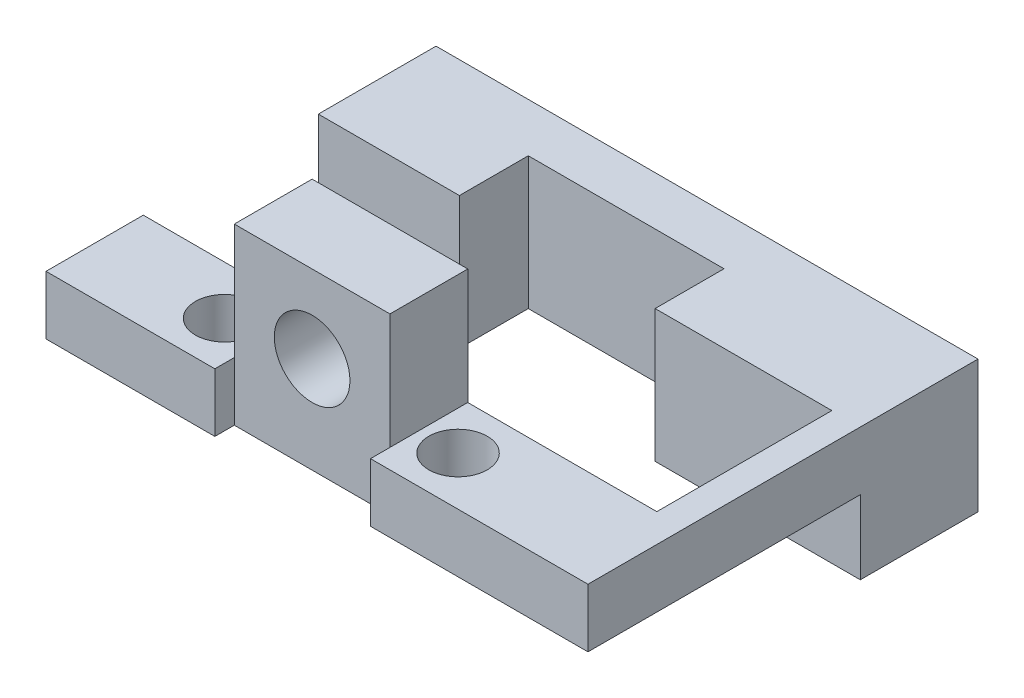
ISO-10303-21;
HEADER;
FILE_DESCRIPTION(('STEP AP214'),'2;1');
FILE_NAME('part.step','',(''),(''),'','','');
FILE_SCHEMA(('AUTOMOTIVE_DESIGN { 1 0 10303 214 1 1 1 1 }'));
ENDSEC;
DATA;
#1=APPLICATION_CONTEXT('core data for automotive mechanical design processes');
#2=APPLICATION_PROTOCOL_DEFINITION('international standard','automotive_design',2000,#1);
#3=PRODUCT_CONTEXT('',#1,'mechanical');
#4=PRODUCT('Part','Part','',(#3));
#5=PRODUCT_RELATED_PRODUCT_CATEGORY('part','',(#4));
#6=PRODUCT_DEFINITION_FORMATION('','',#4);
#7=PRODUCT_DEFINITION_CONTEXT('part definition',#1,'design');
#8=PRODUCT_DEFINITION('design','',#6,#7);
#9=PRODUCT_DEFINITION_SHAPE('','',#8);
#10=(LENGTH_UNIT() NAMED_UNIT(*) SI_UNIT(.MILLI.,.METRE.));
#11=(NAMED_UNIT(*) PLANE_ANGLE_UNIT() SI_UNIT($,.RADIAN.));
#12=(NAMED_UNIT(*) SI_UNIT($,.STERADIAN.) SOLID_ANGLE_UNIT());
#13=UNCERTAINTY_MEASURE_WITH_UNIT(LENGTH_MEASURE(1.E-05),#10,'distance_accuracy_value','');
#14=(GEOMETRIC_REPRESENTATION_CONTEXT(3) GLOBAL_UNCERTAINTY_ASSIGNED_CONTEXT((#13)) GLOBAL_UNIT_ASSIGNED_CONTEXT((#10,
#11,#12)) REPRESENTATION_CONTEXT('',''));
#15=CARTESIAN_POINT('',(0.,0.,0.));
#16=DIRECTION('',(0.,0.,1.));
#17=DIRECTION('',(1.,0.,0.));
#18=AXIS2_PLACEMENT_3D('',#15,#16,#17);
#19=CARTESIAN_POINT('',(-115.927075049262,72.3641175869503,-8.99747351405628));
#20=DIRECTION('',(0.,0.,1.));
#21=DIRECTION('',(1.,0.,0.));
#22=AXIS2_PLACEMENT_3D('',#19,#20,#21);
#23=PLANE('',#22);
#24=DIRECTION('',(0.,1.,0.));
#25=VECTOR('',#24,1.);
#26=CARTESIAN_POINT('',(-115.090412929412,72.3641175869503,-8.99747351405628));
#27=LINE('',#26,#25);
#28=CARTESIAN_POINT('',(-115.090412929412,68.5720536597553,-8.99747351405628));
#29=VERTEX_POINT('',#28);
#30=CARTESIAN_POINT('',(-115.090412929412,75.3756723250068,-8.99747351405628));
#31=VERTEX_POINT('',#30);
#32=EDGE_CURVE('E268',#29,#31,#27,.T.);
#33=ORIENTED_EDGE('',*,*,#32,.F.);
#34=DIRECTION('',(-1.,0.,0.));
#35=VECTOR('',#34,1.);
#36=CARTESIAN_POINT('',(-107.839255233851,68.5720536597553,-8.99747351405628));
#37=LINE('',#36,#35);
#38=CARTESIAN_POINT('',(-107.839255233851,68.5720536597553,-8.99747351405628));
#39=VERTEX_POINT('',#38);
#40=EDGE_CURVE('E180',#39,#29,#37,.T.);
#41=ORIENTED_EDGE('',*,*,#40,.F.);
#42=DIRECTION('',(0.,1.,0.));
#43=VECTOR('',#42,1.);
#44=CARTESIAN_POINT('',(-107.839255233851,69.5709320094176,-8.99747351405628));
#45=LINE('',#44,#43);
#46=CARTESIAN_POINT('',(-107.839255233851,75.3756723250068,-8.99747351405628));
#47=VERTEX_POINT('',#46);
#48=EDGE_CURVE('E424',#39,#47,#45,.T.);
#49=ORIENTED_EDGE('',*,*,#48,.T.);
#50=DIRECTION('',(1.,0.,0.));
#51=VECTOR('',#50,1.);
#52=CARTESIAN_POINT('',(-115.927075049262,75.3756723250068,-8.99747351405628));
#53=LINE('',#52,#51);
#54=EDGE_CURVE('E302',#31,#47,#53,.T.);
#55=ORIENTED_EDGE('',*,*,#54,.F.);
#56=EDGE_LOOP('',(#33,#41,#49,#55));
#57=FACE_BOUND('',#56,.T.);
#58=ADVANCED_FACE('F38',(#57),#23,.T.);
#59=CARTESIAN_POINT('',(-87.2332125363838,0.,0.));
#60=DIRECTION('',(1.,0.,0.));
#61=DIRECTION('',(0.,0.,-1.));
#62=AXIS2_PLACEMENT_3D('',#59,#60,#61);
#63=PLANE('',#62);
#64=DIRECTION('',(0.,1.,0.));
#65=VECTOR('',#64,1.);
#66=CARTESIAN_POINT('',(-87.2332125363838,59.9643896199509,-8.99747351405628));
#67=LINE('',#66,#65);
#68=CARTESIAN_POINT('',(-87.2332125363838,68.5720536597553,-8.99747351405628));
#69=VERTEX_POINT('',#68);
#70=CARTESIAN_POINT('',(-87.2332125363838,72.3641175869503,-8.99747351405628));
#71=VERTEX_POINT('',#70);
#72=EDGE_CURVE('E205',#69,#71,#67,.T.);
#73=ORIENTED_EDGE('',*,*,#72,.F.);
#74=DIRECTION('',(0.,0.,1.));
#75=VECTOR('',#74,1.);
#76=CARTESIAN_POINT('',(-87.2332125363838,68.5720536597553,-15.0472417515523));
#77=LINE('',#76,#75);
#78=CARTESIAN_POINT('',(-87.2332125363838,68.5720536597553,-15.0472417515523));
#79=VERTEX_POINT('',#78);
#80=EDGE_CURVE('E194',#79,#69,#77,.T.);
#81=ORIENTED_EDGE('',*,*,#80,.F.);
#82=DIRECTION('',(0.,1.,0.));
#83=VECTOR('',#82,1.);
#84=CARTESIAN_POINT('',(-87.2332125363838,69.5720536597553,-15.0472417515523));
#85=LINE('',#84,#83);
#86=CARTESIAN_POINT('',(-87.2332125363838,75.3756723250068,-15.0472417515523));
#87=VERTEX_POINT('',#86);
#88=EDGE_CURVE('E192',#79,#87,#85,.T.);
#89=ORIENTED_EDGE('',*,*,#88,.T.);
#90=DIRECTION('',(0.,0.,1.));
#91=VECTOR('',#90,1.);
#92=CARTESIAN_POINT('',(-87.2332125363838,75.3756723250068,0.));
#93=LINE('',#92,#91);
#94=CARTESIAN_POINT('',(-87.2332125363838,75.3756723250068,5.));
#95=VERTEX_POINT('',#94);
#96=EDGE_CURVE('E324',#87,#95,#93,.T.);
#97=ORIENTED_EDGE('',*,*,#96,.T.);
#98=DIRECTION('',(0.,-1.,0.));
#99=VECTOR('',#98,1.);
#100=CARTESIAN_POINT('',(-87.2332125363838,75.3756723250068,5.));
#101=LINE('',#100,#99);
#102=CARTESIAN_POINT('',(-87.2332125363838,72.3641175869503,5.));
#103=VERTEX_POINT('',#102);
#104=EDGE_CURVE('E327',#95,#103,#101,.T.);
#105=ORIENTED_EDGE('',*,*,#104,.T.);
#106=DIRECTION('',(0.,0.,-1.));
#107=VECTOR('',#106,1.);
#108=CARTESIAN_POINT('',(-87.2332125363838,72.3641175869503,5.));
#109=LINE('',#108,#107);
#110=EDGE_CURVE('E315',#103,#71,#109,.T.);
#111=ORIENTED_EDGE('',*,*,#110,.T.);
#112=EDGE_LOOP('',(#73,#81,#89,#97,#105,#111));
#113=FACE_BOUND('',#112,.T.);
#114=ADVANCED_FACE('F387',(#113),#63,.T.);
#115=DIRECTION('',(0.,1.,0.));
#116=VECTOR('',#115,1.);
#117=CARTESIAN_POINT('',(-97.7794834399905,69.5662453583504,-8.99747351405628));
#118=LINE('',#117,#116);
#119=CARTESIAN_POINT('',(-97.7794834399905,68.5720536597553,-8.99747351405628));
#120=VERTEX_POINT('',#119);
#121=CARTESIAN_POINT('',(-97.7794834399905,75.3756723250068,-8.99747351405628));
#122=VERTEX_POINT('',#121);
#123=EDGE_CURVE('E408',#120,#122,#118,.T.);
#124=ORIENTED_EDGE('',*,*,#123,.F.);
#125=DIRECTION('',(-1.,0.,0.));
#126=VECTOR('',#125,1.);
#127=CARTESIAN_POINT('',(-87.2332125363838,68.5720536597553,-8.99747351405628));
#128=LINE('',#127,#126);
#129=EDGE_CURVE('E409',#69,#120,#128,.T.);
#130=ORIENTED_EDGE('',*,*,#129,.F.);
#131=ORIENTED_EDGE('',*,*,#72,.T.);
#132=DIRECTION('',(-1.,0.,0.));
#133=VECTOR('',#132,1.);
#134=CARTESIAN_POINT('',(-95.7794834399905,72.3641175869503,-8.99747351405628));
#135=LINE('',#134,#133);
#136=CARTESIAN_POINT('',(-89.2348545159608,72.3641175869503,-8.99747351405628));
#137=VERTEX_POINT('',#136);
#138=EDGE_CURVE('E201',#71,#137,#135,.T.);
#139=ORIENTED_EDGE('',*,*,#138,.T.);
#140=DIRECTION('',(-0.176425480574125,-0.984313999597786,0.));
#141=VECTOR('',#140,1.);
#142=CARTESIAN_POINT('',(-88.6950725031539,75.3756723250068,-8.99747351405628));
#143=LINE('',#142,#141);
#144=CARTESIAN_POINT('',(-88.6950725031539,75.3756723250068,-8.99747351405628));
#145=VERTEX_POINT('',#144);
#146=EDGE_CURVE('E306',#145,#137,#143,.T.);
#147=ORIENTED_EDGE('',*,*,#146,.F.);
#148=EDGE_CURVE('E301',#122,#145,#53,.T.);
#149=ORIENTED_EDGE('',*,*,#148,.F.);
#150=EDGE_LOOP('',(#124,#130,#131,#139,#147,#149));
#151=FACE_BOUND('',#150,.T.);
#152=ADVANCED_FACE('F390',(#151),#23,.T.);
#153=CARTESIAN_POINT('',(-115.090412929412,76.3641175869503,0.));
#154=DIRECTION('',(1.,0.,0.));
#155=DIRECTION('',(0.,0.,-1.));
#156=AXIS2_PLACEMENT_3D('',#153,#154,#155);
#157=PLANE('',#156);
#158=DIRECTION('',(0.,0.,-1.));
#159=VECTOR('',#158,1.);
#160=CARTESIAN_POINT('',(-115.090412929412,68.5720536597553,-8.99747351405628));
#161=LINE('',#160,#159);
#162=CARTESIAN_POINT('',(-115.090412929412,68.5720536597553,-15.0472417515523));
#163=VERTEX_POINT('',#162);
#164=EDGE_CURVE('E174',#29,#163,#161,.T.);
#165=ORIENTED_EDGE('',*,*,#164,.F.);
#166=ORIENTED_EDGE('',*,*,#32,.T.);
#167=DIRECTION('',(0.,0.,1.));
#168=VECTOR('',#167,1.);
#169=CARTESIAN_POINT('',(-115.090412929412,75.3756723250068,5.));
#170=LINE('',#169,#168);
#171=CARTESIAN_POINT('',(-115.090412929412,75.3756723250068,-15.0472417515523));
#172=VERTEX_POINT('',#171);
#173=EDGE_CURVE('E198',#172,#31,#170,.T.);
#174=ORIENTED_EDGE('',*,*,#173,.F.);
#175=DIRECTION('',(0.,1.,0.));
#176=VECTOR('',#175,1.);
#177=CARTESIAN_POINT('',(-115.090412929412,69.5720536597553,-15.0472417515523));
#178=LINE('',#177,#176);
#179=EDGE_CURVE('E190',#163,#172,#178,.T.);
#180=ORIENTED_EDGE('',*,*,#179,.F.);
#181=EDGE_LOOP('',(#165,#166,#174,#180));
#182=FACE_BOUND('',#181,.T.);
#183=ADVANCED_FACE('F196',(#182),#157,.F.);
#184=CARTESIAN_POINT('',(-87.2332125363838,69.5720536597553,-15.0472417515523));
#185=DIRECTION('',(0.,0.,-1.));
#186=DIRECTION('',(-1.,0.,0.));
#187=AXIS2_PLACEMENT_3D('',#184,#185,#186);
#188=PLANE('',#187);
#189=ORIENTED_EDGE('',*,*,#88,.F.);
#190=DIRECTION('',(1.,0.,0.));
#191=VECTOR('',#190,1.);
#192=CARTESIAN_POINT('',(-115.090412929412,68.5720536597553,-15.0472417515523));
#193=LINE('',#192,#191);
#194=EDGE_CURVE('E177',#163,#79,#193,.T.);
#195=ORIENTED_EDGE('',*,*,#194,.F.);
#196=ORIENTED_EDGE('',*,*,#179,.T.);
#197=DIRECTION('',(-1.,0.,0.));
#198=VECTOR('',#197,1.);
#199=CARTESIAN_POINT('',(-87.2332125363838,75.3756723250068,-15.0472417515523));
#200=LINE('',#199,#198);
#201=EDGE_CURVE('E207',#87,#172,#200,.T.);
#202=ORIENTED_EDGE('',*,*,#201,.F.);
#203=EDGE_LOOP('',(#189,#195,#196,#202));
#204=FACE_BOUND('',#203,.T.);
#205=ADVANCED_FACE('F188',(#204),#188,.T.);
#206=CARTESIAN_POINT('',(-108.839255233851,69.5709320094176,-12.5383641954253));
#207=DIRECTION('',(0.,0.,-1.));
#208=DIRECTION('',(-1.,0.,0.));
#209=AXIS2_PLACEMENT_3D('',#206,#207,#208);
#210=PLANE('',#209);
#211=DIRECTION('',(-1.,0.,0.));
#212=VECTOR('',#211,1.);
#213=CARTESIAN_POINT('',(-97.7794834399905,68.5720536597553,-12.5383641954253));
#214=LINE('',#213,#212);
#215=CARTESIAN_POINT('',(-97.7794834399905,68.5720536597553,-12.5383641954253));
#216=VERTEX_POINT('',#215);
#217=CARTESIAN_POINT('',(-107.839255233851,68.5720536597553,-12.5383641954253));
#218=VERTEX_POINT('',#217);
#219=EDGE_CURVE('E54',#216,#218,#214,.T.);
#220=ORIENTED_EDGE('',*,*,#219,.F.);
#221=DIRECTION('',(0.,1.,0.));
#222=VECTOR('',#221,1.);
#223=CARTESIAN_POINT('',(-97.7794834399905,69.5709320094176,-12.5383641954253));
#224=LINE('',#223,#222);
#225=CARTESIAN_POINT('',(-97.7794834399905,75.3756723250068,-12.5383641954253));
#226=VERTEX_POINT('',#225);
#227=EDGE_CURVE('E11',#216,#226,#224,.T.);
#228=ORIENTED_EDGE('',*,*,#227,.T.);
#229=DIRECTION('',(-1.,0.,0.));
#230=VECTOR('',#229,1.);
#231=CARTESIAN_POINT('',(-108.839255233851,75.3756723250068,-12.5383641954253));
#232=LINE('',#231,#230);
#233=CARTESIAN_POINT('',(-107.839255233851,75.3756723250068,-12.5383641954253));
#234=VERTEX_POINT('',#233);
#235=EDGE_CURVE('E417',#226,#234,#232,.T.);
#236=ORIENTED_EDGE('',*,*,#235,.T.);
#237=DIRECTION('',(0.,1.,0.));
#238=VECTOR('',#237,1.);
#239=CARTESIAN_POINT('',(-107.839255233851,69.5709320094176,-12.5383641954253));
#240=LINE('',#239,#238);
#241=EDGE_CURVE('E61',#218,#234,#240,.T.);
#242=ORIENTED_EDGE('',*,*,#241,.F.);
#243=EDGE_LOOP('',(#220,#228,#236,#242));
#244=FACE_BOUND('',#243,.T.);
#245=ADVANCED_FACE('F512',(#244),#210,.F.);
#246=CARTESIAN_POINT('',(-97.7794834399905,69.5662453583504,-8.99747351405628));
#247=DIRECTION('',(-1.,0.,0.));
#248=DIRECTION('',(0.,0.,1.));
#249=AXIS2_PLACEMENT_3D('',#246,#247,#248);
#250=PLANE('',#249);
#251=ORIENTED_EDGE('',*,*,#227,.F.);
#252=DIRECTION('',(0.,0.,-1.));
#253=VECTOR('',#252,1.);
#254=CARTESIAN_POINT('',(-97.7794834399905,68.5720536597553,-8.99747351405628));
#255=LINE('',#254,#253);
#256=EDGE_CURVE('E440',#120,#216,#255,.T.);
#257=ORIENTED_EDGE('',*,*,#256,.F.);
#258=ORIENTED_EDGE('',*,*,#123,.T.);
#259=DIRECTION('',(0.,0.,1.));
#260=VECTOR('',#259,1.);
#261=CARTESIAN_POINT('',(-97.7794834399905,75.3756723250068,-8.99747351405628));
#262=LINE('',#261,#260);
#263=EDGE_CURVE('E418',#226,#122,#262,.T.);
#264=ORIENTED_EDGE('',*,*,#263,.F.);
#265=EDGE_LOOP('',(#251,#257,#258,#264));
#266=FACE_BOUND('',#265,.T.);
#267=ADVANCED_FACE('F511',(#266),#250,.T.);
#268=CARTESIAN_POINT('',(-107.839255233851,69.5709320094176,-8.99747351405628));
#269=DIRECTION('',(1.,0.,0.));
#270=DIRECTION('',(0.,0.,-1.));
#271=AXIS2_PLACEMENT_3D('',#268,#269,#270);
#272=PLANE('',#271);
#273=ORIENTED_EDGE('',*,*,#48,.F.);
#274=DIRECTION('',(0.,0.,1.));
#275=VECTOR('',#274,1.);
#276=CARTESIAN_POINT('',(-107.839255233851,68.5720536597553,-12.5383641954253));
#277=LINE('',#276,#275);
#278=EDGE_CURVE('E435',#218,#39,#277,.T.);
#279=ORIENTED_EDGE('',*,*,#278,.F.);
#280=ORIENTED_EDGE('',*,*,#241,.T.);
#281=DIRECTION('',(0.,0.,-1.));
#282=VECTOR('',#281,1.);
#283=CARTESIAN_POINT('',(-107.839255233851,75.3756723250068,-8.99747351405628));
#284=LINE('',#283,#282);
#285=EDGE_CURVE('E427',#47,#234,#284,.T.);
#286=ORIENTED_EDGE('',*,*,#285,.F.);
#287=EDGE_LOOP('',(#273,#279,#280,#286));
#288=FACE_BOUND('',#287,.T.);
#289=ADVANCED_FACE('F507',(#288),#272,.T.);
#290=CARTESIAN_POINT('',(-114.442913217313,72.3641175869503,5.));
#291=DIRECTION('',(0.,1.,0.));
#292=DIRECTION('',(0.,0.,1.));
#293=AXIS2_PLACEMENT_3D('',#290,#291,#292);
#294=PLANE('',#293);
#295=CARTESIAN_POINT('',(-108.41180304333,72.3641175869503,2.5));
#296=DIRECTION('',(0.,1.,0.));
#297=DIRECTION('',(0.,0.,1.));
#298=AXIS2_PLACEMENT_3D('',#295,#296,#297);
#299=CIRCLE('',#298,1.5);
#300=CARTESIAN_POINT('',(-108.41180304333,72.3641175869503,4.));
#301=VERTEX_POINT('',#300);
#302=EDGE_CURVE('E253',#301,#301,#299,.T.);
#303=ORIENTED_EDGE('',*,*,#302,.T.);
#304=EDGE_LOOP('',(#303));
#305=FACE_BOUND('',#304,.T.);
#306=CARTESIAN_POINT('',(-96.4119975033768,72.3641175869503,2.5));
#307=DIRECTION('',(0.,1.,0.));
#308=DIRECTION('',(0.,0.,1.));
#309=AXIS2_PLACEMENT_3D('',#306,#307,#308);
#310=CIRCLE('',#309,1.5);
#311=CARTESIAN_POINT('',(-96.4119975033768,72.3641175869503,4.));
#312=VERTEX_POINT('',#311);
#313=EDGE_CURVE('E260',#312,#312,#310,.T.);
#314=ORIENTED_EDGE('',*,*,#313,.T.);
#315=EDGE_LOOP('',(#314));
#316=FACE_BOUND('',#315,.T.);
#317=ORIENTED_EDGE('',*,*,#138,.F.);
#318=ORIENTED_EDGE('',*,*,#110,.F.);
#319=DIRECTION('',(1.,0.,0.));
#320=VECTOR('',#319,1.);
#321=CARTESIAN_POINT('',(-114.442913217313,72.3641175869503,5.));
#322=LINE('',#321,#320);
#323=CARTESIAN_POINT('',(-98.4119975033768,72.3641175869503,5.));
#324=VERTEX_POINT('',#323);
#325=EDGE_CURVE('E341',#324,#103,#322,.T.);
#326=ORIENTED_EDGE('',*,*,#325,.F.);
#327=DIRECTION('',(0.,0.,1.));
#328=VECTOR('',#327,1.);
#329=CARTESIAN_POINT('',(-98.4119975033768,72.3641175869503,4.));
#330=LINE('',#329,#328);
#331=CARTESIAN_POINT('',(-98.4119975033768,72.3641175869503,4.));
#332=VERTEX_POINT('',#331);
#333=EDGE_CURVE('E238',#332,#324,#330,.T.);
#334=ORIENTED_EDGE('',*,*,#333,.F.);
#335=DIRECTION('',(1.,0.,0.));
#336=VECTOR('',#335,1.);
#337=CARTESIAN_POINT('',(-106.41180304333,72.3641175869503,4.));
#338=LINE('',#337,#336);
#339=CARTESIAN_POINT('',(-106.41180304333,72.3641175869503,4.));
#340=VERTEX_POINT('',#339);
#341=EDGE_CURVE('E219',#340,#332,#338,.T.);
#342=ORIENTED_EDGE('',*,*,#341,.F.);
#343=DIRECTION('',(0.,0.,1.));
#344=VECTOR('',#343,1.);
#345=CARTESIAN_POINT('',(-106.41180304333,72.3641175869503,4.));
#346=LINE('',#345,#344);
#347=CARTESIAN_POINT('',(-106.41180304333,72.3641175869503,5.));
#348=VERTEX_POINT('',#347);
#349=EDGE_CURVE('E232',#340,#348,#346,.T.);
#350=ORIENTED_EDGE('',*,*,#349,.T.);
#351=CARTESIAN_POINT('',(-115.090412929412,72.3641175869503,5.));
#352=VERTEX_POINT('',#351);
#353=EDGE_CURVE('E336',#352,#348,#322,.T.);
#354=ORIENTED_EDGE('',*,*,#353,.F.);
#355=DIRECTION('',(0.,0.,1.));
#356=VECTOR('',#355,1.);
#357=CARTESIAN_POINT('',(-115.090412929412,72.3641175869503,0.));
#358=LINE('',#357,#356);
#359=CARTESIAN_POINT('',(-115.090412929412,72.3641175869503,0.));
#360=VERTEX_POINT('',#359);
#361=EDGE_CURVE('E261',#360,#352,#358,.T.);
#362=ORIENTED_EDGE('',*,*,#361,.F.);
#363=DIRECTION('',(1.,0.,0.));
#364=VECTOR('',#363,1.);
#365=CARTESIAN_POINT('',(-114.442913217313,72.3641175869503,0.));
#366=LINE('',#365,#364);
#367=CARTESIAN_POINT('',(-89.2348545159608,72.3641175869503,0.));
#368=VERTEX_POINT('',#367);
#369=EDGE_CURVE('E335',#360,#368,#366,.T.);
#370=ORIENTED_EDGE('',*,*,#369,.T.);
#371=DIRECTION('',(0.,0.,1.));
#372=VECTOR('',#371,1.);
#373=CARTESIAN_POINT('',(-89.2348545159608,72.3641175869503,-19.2714813286063));
#374=LINE('',#373,#372);
#375=EDGE_CURVE('E316',#137,#368,#374,.T.);
#376=ORIENTED_EDGE('',*,*,#375,.F.);
#377=EDGE_LOOP('',(#317,#318,#326,#334,#342,#350,#354,#362,#370,#376));
#378=FACE_BOUND('',#377,.T.);
#379=ADVANCED_FACE('F40',(#305,#316,#378),#294,.F.);
#380=CARTESIAN_POINT('',(-102.411900273353,77.3190420389732,5.));
#381=DIRECTION('',(0.,0.,1.));
#382=DIRECTION('',(1.,0.,0.));
#383=AXIS2_PLACEMENT_3D('',#380,#381,#382);
#384=PLANE('',#383);
#385=DIRECTION('',(0.,1.,0.));
#386=VECTOR('',#385,1.);
#387=CARTESIAN_POINT('',(-98.4119975033768,81.31894480895,5.));
#388=LINE('',#387,#386);
#389=CARTESIAN_POINT('',(-98.4119975033768,75.3756723250068,5.));
#390=VERTEX_POINT('',#389);
#391=EDGE_CURVE('E235',#324,#390,#388,.T.);
#392=ORIENTED_EDGE('',*,*,#391,.F.);
#393=ORIENTED_EDGE('',*,*,#325,.T.);
#394=ORIENTED_EDGE('',*,*,#104,.F.);
#395=DIRECTION('',(-1.,0.,0.));
#396=VECTOR('',#395,1.);
#397=CARTESIAN_POINT('',(-88.2332125363838,75.3756723250068,5.));
#398=LINE('',#397,#396);
#399=EDGE_CURVE('E340',#95,#390,#398,.T.);
#400=ORIENTED_EDGE('',*,*,#399,.T.);
#401=EDGE_LOOP('',(#392,#393,#394,#400));
#402=FACE_BOUND('',#401,.T.);
#403=ADVANCED_FACE('F503',(#402),#384,.T.);
#404=CARTESIAN_POINT('',(-102.411900273353,77.3190420389732,5.));
#405=DIRECTION('',(0.,0.,-1.));
#406=DIRECTION('',(-1.,0.,0.));
#407=AXIS2_PLACEMENT_3D('',#404,#405,#406);
#408=CYLINDRICAL_SURFACE('',#407,1.94336971396638);
#409=CARTESIAN_POINT('',(-102.411900273353,77.3190420389732,0.));
#410=DIRECTION('',(0.,0.,1.));
#411=DIRECTION('',(1.,0.,0.));
#412=AXIS2_PLACEMENT_3D('',#409,#410,#411);
#413=CIRCLE('',#412,1.94336971396638);
#414=CARTESIAN_POINT('',(-100.468530559387,77.3190420389732,0.));
#415=VERTEX_POINT('',#414);
#416=EDGE_CURVE('E331',#415,#415,#413,.T.);
#417=ORIENTED_EDGE('',*,*,#416,.F.);
#418=EDGE_LOOP('',(#417));
#419=FACE_BOUND('',#418,.T.);
#420=CARTESIAN_POINT('',(-102.411900273353,77.3190420389732,4.));
#421=DIRECTION('',(0.,0.,1.));
#422=DIRECTION('',(1.,0.,0.));
#423=AXIS2_PLACEMENT_3D('',#420,#421,#422);
#424=CIRCLE('',#423,1.94336971396638);
#425=CARTESIAN_POINT('',(-100.468530559387,77.3190420389732,4.));
#426=VERTEX_POINT('',#425);
#427=EDGE_CURVE('E241',#426,#426,#424,.T.);
#428=ORIENTED_EDGE('',*,*,#427,.T.);
#429=EDGE_LOOP('',(#428));
#430=FACE_BOUND('',#429,.T.);
#431=ADVANCED_FACE('F691',(#419,#430),#408,.F.);
#432=CARTESIAN_POINT('',(-106.41180304333,81.31894480895,0.));
#433=DIRECTION('',(0.,1.,0.));
#434=DIRECTION('',(0.,0.,1.));
#435=AXIS2_PLACEMENT_3D('',#432,#433,#434);
#436=PLANE('',#435);
#437=DIRECTION('',(0.,0.,1.));
#438=VECTOR('',#437,1.);
#439=CARTESIAN_POINT('',(-106.41180304333,81.31894480895,0.));
#440=LINE('',#439,#438);
#441=CARTESIAN_POINT('',(-106.41180304333,81.31894480895,0.));
#442=VERTEX_POINT('',#441);
#443=CARTESIAN_POINT('',(-106.41180304333,81.31894480895,4.));
#444=VERTEX_POINT('',#443);
#445=EDGE_CURVE('E288',#442,#444,#440,.T.);
#446=ORIENTED_EDGE('',*,*,#445,.T.);
#447=DIRECTION('',(-1.,0.,0.));
#448=VECTOR('',#447,1.);
#449=CARTESIAN_POINT('',(-106.41180304333,81.31894480895,4.));
#450=LINE('',#449,#448);
#451=CARTESIAN_POINT('',(-98.4119975033768,81.31894480895,4.));
#452=VERTEX_POINT('',#451);
#453=EDGE_CURVE('E229',#452,#444,#450,.T.);
#454=ORIENTED_EDGE('',*,*,#453,.F.);
#455=DIRECTION('',(0.,0.,1.));
#456=VECTOR('',#455,1.);
#457=CARTESIAN_POINT('',(-98.4119975033768,81.31894480895,0.));
#458=LINE('',#457,#456);
#459=CARTESIAN_POINT('',(-98.4119975033768,81.31894480895,0.));
#460=VERTEX_POINT('',#459);
#461=EDGE_CURVE('E289',#460,#452,#458,.T.);
#462=ORIENTED_EDGE('',*,*,#461,.F.);
#463=DIRECTION('',(-1.,0.,0.));
#464=VECTOR('',#463,1.);
#465=CARTESIAN_POINT('',(-106.41180304333,81.31894480895,0.));
#466=LINE('',#465,#464);
#467=EDGE_CURVE('E278',#460,#442,#466,.T.);
#468=ORIENTED_EDGE('',*,*,#467,.T.);
#469=EDGE_LOOP('',(#446,#454,#462,#468));
#470=FACE_BOUND('',#469,.T.);
#471=ADVANCED_FACE('F473',(#470),#436,.T.);
#472=CARTESIAN_POINT('',(-98.4119975033768,75.0380041016321,0.));
#473=DIRECTION('',(1.,0.,0.));
#474=DIRECTION('',(0.,0.,-1.));
#475=AXIS2_PLACEMENT_3D('',#472,#473,#474);
#476=PLANE('',#475);
#477=ORIENTED_EDGE('',*,*,#461,.T.);
#478=DIRECTION('',(0.,1.,0.));
#479=VECTOR('',#478,1.);
#480=CARTESIAN_POINT('',(-98.4119975033768,72.3641175869503,4.));
#481=LINE('',#480,#479);
#482=CARTESIAN_POINT('',(-98.4119975033768,75.3756723250068,4.));
#483=VERTEX_POINT('',#482);
#484=EDGE_CURVE('E224',#483,#452,#481,.T.);
#485=ORIENTED_EDGE('',*,*,#484,.F.);
#486=DIRECTION('',(0.,0.,1.));
#487=VECTOR('',#486,1.);
#488=CARTESIAN_POINT('',(-98.4119975033768,75.3756723250068,5.));
#489=LINE('',#488,#487);
#490=CARTESIAN_POINT('',(-98.4119975033768,75.3756723250068,0.));
#491=VERTEX_POINT('',#490);
#492=EDGE_CURVE('E297',#491,#483,#489,.T.);
#493=ORIENTED_EDGE('',*,*,#492,.F.);
#494=DIRECTION('',(0.,1.,0.));
#495=VECTOR('',#494,1.);
#496=CARTESIAN_POINT('',(-98.4119975033768,75.0380041016321,0.));
#497=LINE('',#496,#495);
#498=EDGE_CURVE('E285',#491,#460,#497,.T.);
#499=ORIENTED_EDGE('',*,*,#498,.T.);
#500=EDGE_LOOP('',(#477,#485,#493,#499));
#501=FACE_BOUND('',#500,.T.);
#502=ADVANCED_FACE('F469',(#501),#476,.T.);
#503=CARTESIAN_POINT('',(-106.41180304333,81.31894480895,0.));
#504=DIRECTION('',(-1.,0.,0.));
#505=DIRECTION('',(0.,0.,1.));
#506=AXIS2_PLACEMENT_3D('',#503,#504,#505);
#507=PLANE('',#506);
#508=DIRECTION('',(0.,0.,-1.));
#509=VECTOR('',#508,1.);
#510=CARTESIAN_POINT('',(-106.41180304333,75.3756723250068,5.));
#511=LINE('',#510,#509);
#512=CARTESIAN_POINT('',(-106.41180304333,75.3756723250068,4.));
#513=VERTEX_POINT('',#512);
#514=CARTESIAN_POINT('',(-106.41180304333,75.3756723250068,0.));
#515=VERTEX_POINT('',#514);
#516=EDGE_CURVE('E349',#513,#515,#511,.T.);
#517=ORIENTED_EDGE('',*,*,#516,.F.);
#518=DIRECTION('',(0.,-1.,0.));
#519=VECTOR('',#518,1.);
#520=CARTESIAN_POINT('',(-106.41180304333,81.31894480895,4.));
#521=LINE('',#520,#519);
#522=EDGE_CURVE('E215',#444,#513,#521,.T.);
#523=ORIENTED_EDGE('',*,*,#522,.F.);
#524=ORIENTED_EDGE('',*,*,#445,.F.);
#525=DIRECTION('',(0.,-1.,0.));
#526=VECTOR('',#525,1.);
#527=CARTESIAN_POINT('',(-106.41180304333,81.31894480895,0.));
#528=LINE('',#527,#526);
#529=EDGE_CURVE('E281',#442,#515,#528,.T.);
#530=ORIENTED_EDGE('',*,*,#529,.T.);
#531=EDGE_LOOP('',(#517,#523,#524,#530));
#532=FACE_BOUND('',#531,.T.);
#533=ADVANCED_FACE('F480',(#532),#507,.T.);
#534=CARTESIAN_POINT('',(-105.907974689625,75.3756723250068,5.));
#535=DIRECTION('',(0.,-1.,0.));
#536=DIRECTION('',(0.,0.,-1.));
#537=AXIS2_PLACEMENT_3D('',#534,#535,#536);
#538=PLANE('',#537);
#539=ORIENTED_EDGE('',*,*,#54,.T.);
#540=ORIENTED_EDGE('',*,*,#285,.T.);
#541=ORIENTED_EDGE('',*,*,#235,.F.);
#542=ORIENTED_EDGE('',*,*,#263,.T.);
#543=ORIENTED_EDGE('',*,*,#148,.T.);
#544=DIRECTION('',(0.,0.,1.));
#545=VECTOR('',#544,1.);
#546=CARTESIAN_POINT('',(-88.6950725031539,75.3756723250068,-19.2714813286063));
#547=LINE('',#546,#545);
#548=CARTESIAN_POINT('',(-88.6950725031539,75.3756723250068,0.));
#549=VERTEX_POINT('',#548);
#550=EDGE_CURVE('E310',#145,#549,#547,.T.);
#551=ORIENTED_EDGE('',*,*,#550,.T.);
#552=DIRECTION('',(-1.,0.,0.));
#553=VECTOR('',#552,1.);
#554=CARTESIAN_POINT('',(-88.2332125363838,75.3756723250068,0.));
#555=LINE('',#554,#553);
#556=EDGE_CURVE('E353',#549,#491,#555,.T.);
#557=ORIENTED_EDGE('',*,*,#556,.T.);
#558=ORIENTED_EDGE('',*,*,#492,.T.);
#559=EDGE_CURVE('E293',#483,#390,#489,.T.);
#560=ORIENTED_EDGE('',*,*,#559,.T.);
#561=ORIENTED_EDGE('',*,*,#399,.F.);
#562=ORIENTED_EDGE('',*,*,#96,.F.);
#563=ORIENTED_EDGE('',*,*,#201,.T.);
#564=ORIENTED_EDGE('',*,*,#173,.T.);
#565=EDGE_LOOP('',(#539,#540,#541,#542,#543,#551,#557,#558,#560,#561,#562,#563,#564));
#566=FACE_BOUND('',#565,.T.);
#567=CARTESIAN_POINT('',(-96.4119975033768,75.3756723250068,2.5));
#568=DIRECTION('',(0.,1.,0.));
#569=DIRECTION('',(0.,0.,1.));
#570=AXIS2_PLACEMENT_3D('',#567,#568,#569);
#571=CIRCLE('',#570,1.5);
#572=CARTESIAN_POINT('',(-96.4119975033768,75.3756723250068,4.));
#573=VERTEX_POINT('',#572);
#574=EDGE_CURVE('E249',#573,#573,#571,.T.);
#575=ORIENTED_EDGE('',*,*,#574,.F.);
#576=EDGE_LOOP('',(#575));
#577=FACE_BOUND('',#576,.T.);
#578=ADVANCED_FACE('F459',(#566,#577),#538,.F.);
#579=CARTESIAN_POINT('',(-102.411900273353,77.3190420389732,0.));
#580=DIRECTION('',(0.,0.,1.));
#581=DIRECTION('',(1.,0.,0.));
#582=AXIS2_PLACEMENT_3D('',#579,#580,#581);
#583=PLANE('',#582);
#584=ORIENTED_EDGE('',*,*,#369,.F.);
#585=DIRECTION('',(0.,1.,0.));
#586=VECTOR('',#585,1.);
#587=CARTESIAN_POINT('',(-115.090412929412,77.3190420389732,0.));
#588=LINE('',#587,#586);
#589=CARTESIAN_POINT('',(-115.090412929412,75.3756723250068,0.));
#590=VERTEX_POINT('',#589);
#591=EDGE_CURVE('E274',#360,#590,#588,.T.);
#592=ORIENTED_EDGE('',*,*,#591,.T.);
#593=DIRECTION('',(-1.,0.,0.));
#594=VECTOR('',#593,1.);
#595=CARTESIAN_POINT('',(-105.907974689625,75.3756723250068,0.));
#596=LINE('',#595,#594);
#597=EDGE_CURVE('E357',#515,#590,#596,.T.);
#598=ORIENTED_EDGE('',*,*,#597,.F.);
#599=ORIENTED_EDGE('',*,*,#529,.F.);
#600=ORIENTED_EDGE('',*,*,#467,.F.);
#601=ORIENTED_EDGE('',*,*,#498,.F.);
#602=ORIENTED_EDGE('',*,*,#556,.F.);
#603=DIRECTION('',(0.176425480574125,0.984313999597786,0.));
#604=VECTOR('',#603,1.);
#605=CARTESIAN_POINT('',(-88.6950725031539,75.3756723250068,0.));
#606=LINE('',#605,#604);
#607=EDGE_CURVE('E311',#368,#549,#606,.T.);
#608=ORIENTED_EDGE('',*,*,#607,.F.);
#609=EDGE_LOOP('',(#584,#592,#598,#599,#600,#601,#602,#608));
#610=FACE_BOUND('',#609,.T.);
#611=ORIENTED_EDGE('',*,*,#416,.T.);
#612=EDGE_LOOP('',(#611));
#613=FACE_BOUND('',#612,.T.);
#614=ADVANCED_FACE('F463',(#610,#613),#583,.F.);
#615=DIRECTION('',(0.,-1.,0.));
#616=VECTOR('',#615,1.);
#617=CARTESIAN_POINT('',(-106.41180304333,75.3756723250068,5.));
#618=LINE('',#617,#616);
#619=CARTESIAN_POINT('',(-106.41180304333,75.3756723250068,5.));
#620=VERTEX_POINT('',#619);
#621=EDGE_CURVE('E214',#620,#348,#618,.T.);
#622=ORIENTED_EDGE('',*,*,#621,.F.);
#623=DIRECTION('',(-1.,0.,0.));
#624=VECTOR('',#623,1.);
#625=CARTESIAN_POINT('',(-105.907974689625,75.3756723250068,5.));
#626=LINE('',#625,#624);
#627=CARTESIAN_POINT('',(-115.090412929412,75.3756723250068,5.));
#628=VERTEX_POINT('',#627);
#629=EDGE_CURVE('E345',#620,#628,#626,.T.);
#630=ORIENTED_EDGE('',*,*,#629,.T.);
#631=DIRECTION('',(0.,-1.,0.));
#632=VECTOR('',#631,1.);
#633=CARTESIAN_POINT('',(-115.090412929412,76.3641175869503,5.));
#634=LINE('',#633,#632);
#635=EDGE_CURVE('E264',#628,#352,#634,.T.);
#636=ORIENTED_EDGE('',*,*,#635,.T.);
#637=ORIENTED_EDGE('',*,*,#353,.T.);
#638=EDGE_LOOP('',(#622,#630,#636,#637));
#639=FACE_BOUND('',#638,.T.);
#640=ADVANCED_FACE('F491',(#639),#384,.T.);
#641=CARTESIAN_POINT('',(-108.41180304333,75.3756723250068,2.5));
#642=DIRECTION('',(0.,1.,0.));
#643=DIRECTION('',(0.,0.,1.));
#644=AXIS2_PLACEMENT_3D('',#641,#642,#643);
#645=CIRCLE('',#644,1.5);
#646=CARTESIAN_POINT('',(-108.41180304333,75.3756723250068,4.));
#647=VERTEX_POINT('',#646);
#648=EDGE_CURVE('E248',#647,#647,#645,.T.);
#649=ORIENTED_EDGE('',*,*,#648,.F.);
#650=EDGE_LOOP('',(#649));
#651=FACE_BOUND('',#650,.T.);
#652=ORIENTED_EDGE('',*,*,#597,.T.);
#653=EDGE_CURVE('E273',#590,#628,#170,.T.);
#654=ORIENTED_EDGE('',*,*,#653,.T.);
#655=ORIENTED_EDGE('',*,*,#629,.F.);
#656=EDGE_CURVE('E47',#620,#513,#511,.T.);
#657=ORIENTED_EDGE('',*,*,#656,.T.);
#658=ORIENTED_EDGE('',*,*,#516,.T.);
#659=EDGE_LOOP('',(#652,#654,#655,#657,#658));
#660=FACE_BOUND('',#659,.T.);
#661=ADVANCED_FACE('F485',(#651,#660),#538,.F.);
#662=CARTESIAN_POINT('',(-88.6950725031539,75.3756723250068,-19.2714813286063));
#663=DIRECTION('',(0.984313999597785,-0.176425480574125,0.));
#664=DIRECTION('',(0.176425480574125,0.984313999597786,0.));
#665=AXIS2_PLACEMENT_3D('',#662,#663,#664);
#666=PLANE('',#665);
#667=ORIENTED_EDGE('',*,*,#550,.F.);
#668=ORIENTED_EDGE('',*,*,#146,.T.);
#669=ORIENTED_EDGE('',*,*,#375,.T.);
#670=ORIENTED_EDGE('',*,*,#607,.T.);
#671=EDGE_LOOP('',(#667,#668,#669,#670));
#672=FACE_BOUND('',#671,.T.);
#673=ADVANCED_FACE('F456',(#672),#666,.F.);
#674=ORIENTED_EDGE('',*,*,#361,.T.);
#675=ORIENTED_EDGE('',*,*,#635,.F.);
#676=ORIENTED_EDGE('',*,*,#653,.F.);
#677=ORIENTED_EDGE('',*,*,#591,.F.);
#678=EDGE_LOOP('',(#674,#675,#676,#677));
#679=FACE_BOUND('',#678,.T.);
#680=ADVANCED_FACE('F382',(#679),#157,.F.);
#681=CARTESIAN_POINT('',(-108.41180304333,71.3756723250068,2.5));
#682=DIRECTION('',(0.,1.,0.));
#683=DIRECTION('',(0.,0.,1.));
#684=AXIS2_PLACEMENT_3D('',#681,#682,#683);
#685=CYLINDRICAL_SURFACE('',#684,1.5);
#686=ORIENTED_EDGE('',*,*,#648,.T.);
#687=EDGE_LOOP('',(#686));
#688=FACE_BOUND('',#687,.T.);
#689=ORIENTED_EDGE('',*,*,#302,.F.);
#690=EDGE_LOOP('',(#689));
#691=FACE_BOUND('',#690,.T.);
#692=ADVANCED_FACE('F372',(#688,#691),#685,.F.);
#693=CARTESIAN_POINT('',(-96.4119975033768,71.3756723250068,2.5));
#694=DIRECTION('',(0.,1.,0.));
#695=DIRECTION('',(0.,0.,1.));
#696=AXIS2_PLACEMENT_3D('',#693,#694,#695);
#697=CYLINDRICAL_SURFACE('',#696,1.5);
#698=ORIENTED_EDGE('',*,*,#574,.T.);
#699=EDGE_LOOP('',(#698));
#700=FACE_BOUND('',#699,.T.);
#701=ORIENTED_EDGE('',*,*,#313,.F.);
#702=EDGE_LOOP('',(#701));
#703=FACE_BOUND('',#702,.T.);
#704=ADVANCED_FACE('F369',(#700,#703),#697,.F.);
#705=CARTESIAN_POINT('',(-98.4119975033768,81.31894480895,4.));
#706=DIRECTION('',(1.,0.,0.));
#707=DIRECTION('',(0.,0.,-1.));
#708=AXIS2_PLACEMENT_3D('',#705,#706,#707);
#709=PLANE('',#708);
#710=EDGE_CURVE('E225',#332,#483,#481,.T.);
#711=ORIENTED_EDGE('',*,*,#710,.F.);
#712=ORIENTED_EDGE('',*,*,#333,.T.);
#713=ORIENTED_EDGE('',*,*,#391,.T.);
#714=ORIENTED_EDGE('',*,*,#559,.F.);
#715=EDGE_LOOP('',(#711,#712,#713,#714));
#716=FACE_BOUND('',#715,.T.);
#717=ADVANCED_FACE('F371',(#716),#709,.F.);
#718=CARTESIAN_POINT('',(-106.41180304333,75.3756723250068,4.));
#719=DIRECTION('',(-1.,0.,0.));
#720=DIRECTION('',(0.,0.,1.));
#721=AXIS2_PLACEMENT_3D('',#718,#719,#720);
#722=PLANE('',#721);
#723=ORIENTED_EDGE('',*,*,#621,.T.);
#724=ORIENTED_EDGE('',*,*,#349,.F.);
#725=EDGE_CURVE('E220',#513,#340,#521,.T.);
#726=ORIENTED_EDGE('',*,*,#725,.F.);
#727=ORIENTED_EDGE('',*,*,#656,.F.);
#728=EDGE_LOOP('',(#723,#724,#726,#727));
#729=FACE_BOUND('',#728,.T.);
#730=ADVANCED_FACE('F379',(#729),#722,.F.);
#731=CARTESIAN_POINT('',(0.,0.,4.));
#732=DIRECTION('',(0.,0.,1.));
#733=DIRECTION('',(1.,0.,0.));
#734=AXIS2_PLACEMENT_3D('',#731,#732,#733);
#735=PLANE('',#734);
#736=ORIENTED_EDGE('',*,*,#427,.F.);
#737=EDGE_LOOP('',(#736));
#738=FACE_BOUND('',#737,.T.);
#739=ORIENTED_EDGE('',*,*,#522,.T.);
#740=ORIENTED_EDGE('',*,*,#725,.T.);
#741=ORIENTED_EDGE('',*,*,#341,.T.);
#742=ORIENTED_EDGE('',*,*,#710,.T.);
#743=ORIENTED_EDGE('',*,*,#484,.T.);
#744=ORIENTED_EDGE('',*,*,#453,.T.);
#745=EDGE_LOOP('',(#739,#740,#741,#742,#743,#744));
#746=FACE_BOUND('',#745,.T.);
#747=ADVANCED_FACE('F477',(#738,#746),#735,.T.);
#748=CARTESIAN_POINT('',(0.,68.5720536597553,0.));
#749=DIRECTION('',(0.,-1.,0.));
#750=DIRECTION('',(0.,0.,-1.));
#751=AXIS2_PLACEMENT_3D('',#748,#749,#750);
#752=PLANE('',#751);
#753=ORIENTED_EDGE('',*,*,#164,.T.);
#754=ORIENTED_EDGE('',*,*,#194,.T.);
#755=ORIENTED_EDGE('',*,*,#80,.T.);
#756=ORIENTED_EDGE('',*,*,#129,.T.);
#757=ORIENTED_EDGE('',*,*,#256,.T.);
#758=ORIENTED_EDGE('',*,*,#219,.T.);
#759=ORIENTED_EDGE('',*,*,#278,.T.);
#760=ORIENTED_EDGE('',*,*,#40,.T.);
#761=EDGE_LOOP('',(#753,#754,#755,#756,#757,#758,#759,#760));
#762=FACE_BOUND('',#761,.T.);
#763=ADVANCED_FACE('F176',(#762),#752,.T.);
#764=CLOSED_SHELL('',(#58,#114,#152,#183,#205,#245,#267,#289,#379,#403,#431,#471,#502,#533,#578,
#614,#640,#661,#673,#680,#692,#704,#717,#730,#747,#763));
#765=MANIFOLD_SOLID_BREP('B2',#764);
#766=ADVANCED_BREP_SHAPE_REPRESENTATION('',(#18,#765),#14);
#767=SHAPE_DEFINITION_REPRESENTATION(#9,#766);
ENDSEC;
END-ISO-10303-21;
